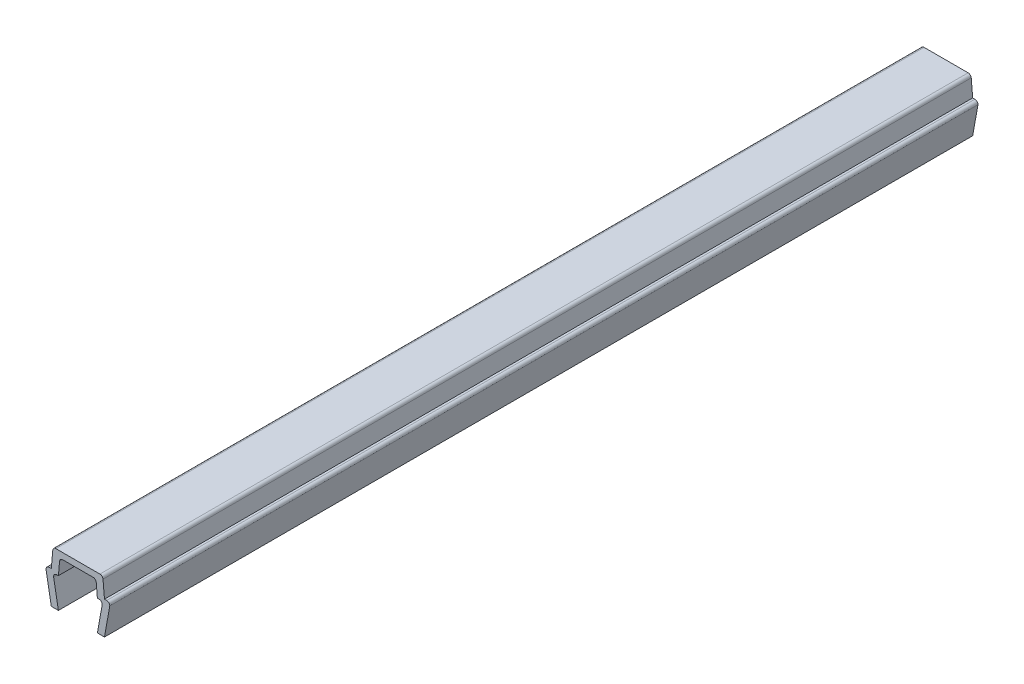
ISO-10303-21;
HEADER;
FILE_DESCRIPTION(('STEP AP214'),'2;1');
FILE_NAME('part.step','',(''),(''),'','','');
FILE_SCHEMA(('AUTOMOTIVE_DESIGN { 1 0 10303 214 1 1 1 1 }'));
ENDSEC;
DATA;
#1=APPLICATION_CONTEXT('core data for automotive mechanical design processes');
#2=APPLICATION_PROTOCOL_DEFINITION('international standard','automotive_design',2000,#1);
#3=PRODUCT_CONTEXT('',#1,'mechanical');
#4=PRODUCT('Part','Part','',(#3));
#5=PRODUCT_RELATED_PRODUCT_CATEGORY('part','',(#4));
#6=PRODUCT_DEFINITION_FORMATION('','',#4);
#7=PRODUCT_DEFINITION_CONTEXT('part definition',#1,'design');
#8=PRODUCT_DEFINITION('design','',#6,#7);
#9=PRODUCT_DEFINITION_SHAPE('','',#8);
#10=(LENGTH_UNIT() NAMED_UNIT(*) SI_UNIT(.MILLI.,.METRE.));
#11=(NAMED_UNIT(*) PLANE_ANGLE_UNIT() SI_UNIT($,.RADIAN.));
#12=(NAMED_UNIT(*) SI_UNIT($,.STERADIAN.) SOLID_ANGLE_UNIT());
#13=UNCERTAINTY_MEASURE_WITH_UNIT(LENGTH_MEASURE(1.E-05),#10,'distance_accuracy_value','');
#14=(GEOMETRIC_REPRESENTATION_CONTEXT(3) GLOBAL_UNCERTAINTY_ASSIGNED_CONTEXT((#13)) GLOBAL_UNIT_ASSIGNED_CONTEXT((#10,
#11,#12)) REPRESENTATION_CONTEXT('',''));
#15=CARTESIAN_POINT('',(0.,0.,0.));
#16=DIRECTION('',(0.,0.,1.));
#17=DIRECTION('',(1.,0.,0.));
#18=AXIS2_PLACEMENT_3D('',#15,#16,#17);
#19=CARTESIAN_POINT('',(-3.25000000000003,3.35000000000003,49.));
#20=DIRECTION('',(0.,0.,-1.));
#21=DIRECTION('',(-1.,0.,0.));
#22=AXIS2_PLACEMENT_3D('',#19,#20,#21);
#23=CYLINDRICAL_SURFACE('',#22,0.349999999999972);
#24=DIRECTION('',(0.,0.,-1.));
#25=VECTOR('',#24,1.);
#26=CARTESIAN_POINT('',(-3.25,3.7,49.));
#27=LINE('',#26,#25);
#28=CARTESIAN_POINT('',(-3.25,3.7,49.));
#29=VERTEX_POINT('',#28);
#30=CARTESIAN_POINT('',(-3.25,3.7,-49.));
#31=VERTEX_POINT('',#30);
#32=EDGE_CURVE('E211',#29,#31,#27,.T.);
#33=ORIENTED_EDGE('',*,*,#32,.T.);
#34=CARTESIAN_POINT('',(-3.25000000000003,3.35000000000003,-49.));
#35=DIRECTION('',(0.,0.,1.));
#36=DIRECTION('',(1.,0.,0.));
#37=AXIS2_PLACEMENT_3D('',#34,#35,#36);
#38=CIRCLE('',#37,0.349999999999972);
#39=CARTESIAN_POINT('',(-3.6,3.35,-49.));
#40=VERTEX_POINT('',#39);
#41=EDGE_CURVE('E205',#31,#40,#38,.T.);
#42=ORIENTED_EDGE('',*,*,#41,.T.);
#43=DIRECTION('',(0.,0.,-1.));
#44=VECTOR('',#43,1.);
#45=CARTESIAN_POINT('',(-3.6,3.35,49.));
#46=LINE('',#45,#44);
#47=CARTESIAN_POINT('',(-3.6,3.35,49.));
#48=VERTEX_POINT('',#47);
#49=EDGE_CURVE('E11',#48,#40,#46,.T.);
#50=ORIENTED_EDGE('',*,*,#49,.F.);
#51=CARTESIAN_POINT('',(-3.25000000000003,3.35000000000003,49.));
#52=DIRECTION('',(0.,0.,1.));
#53=DIRECTION('',(1.,0.,0.));
#54=AXIS2_PLACEMENT_3D('',#51,#52,#53);
#55=CIRCLE('',#54,0.349999999999972);
#56=EDGE_CURVE('E277',#29,#48,#55,.T.);
#57=ORIENTED_EDGE('',*,*,#56,.F.);
#58=EDGE_LOOP('',(#33,#42,#50,#57));
#59=FACE_BOUND('',#58,.T.);
#60=ADVANCED_FACE('F33',(#59),#23,.T.);
#61=CARTESIAN_POINT('',(-3.6,3.35,49.));
#62=DIRECTION('',(0.984336643247304,0.176299100283099,0.));
#63=DIRECTION('',(-0.176299100283099,0.984336643247304,0.));
#64=AXIS2_PLACEMENT_3D('',#61,#62,#63);
#65=PLANE('',#64);
#66=ORIENTED_EDGE('',*,*,#49,.T.);
#67=DIRECTION('',(0.176299100283099,-0.984336643247304,0.));
#68=VECTOR('',#67,1.);
#69=CARTESIAN_POINT('',(-3.6,3.35,-49.));
#70=LINE('',#69,#68);
#71=CARTESIAN_POINT('',(-3.,0.,-49.));
#72=VERTEX_POINT('',#71);
#73=EDGE_CURVE('E195',#40,#72,#70,.T.);
#74=ORIENTED_EDGE('',*,*,#73,.T.);
#75=DIRECTION('',(0.,0.,-1.));
#76=VECTOR('',#75,1.);
#77=CARTESIAN_POINT('',(-3.,0.,49.));
#78=LINE('',#77,#76);
#79=CARTESIAN_POINT('',(-3.,0.,49.));
#80=VERTEX_POINT('',#79);
#81=EDGE_CURVE('E40',#80,#72,#78,.T.);
#82=ORIENTED_EDGE('',*,*,#81,.F.);
#83=DIRECTION('',(0.176299100283099,-0.984336643247304,0.));
#84=VECTOR('',#83,1.);
#85=CARTESIAN_POINT('',(-3.6,3.35,49.));
#86=LINE('',#85,#84);
#87=EDGE_CURVE('E196',#48,#80,#86,.T.);
#88=ORIENTED_EDGE('',*,*,#87,.F.);
#89=EDGE_LOOP('',(#66,#74,#82,#88));
#90=FACE_BOUND('',#89,.T.);
#91=ADVANCED_FACE('F193',(#90),#65,.F.);
#92=CARTESIAN_POINT('',(-3.,0.,49.));
#93=DIRECTION('',(0.,1.,0.));
#94=DIRECTION('',(0.,0.,1.));
#95=AXIS2_PLACEMENT_3D('',#92,#93,#94);
#96=PLANE('',#95);
#97=ORIENTED_EDGE('',*,*,#81,.T.);
#98=DIRECTION('',(1.,0.,0.));
#99=VECTOR('',#98,1.);
#100=CARTESIAN_POINT('',(-3.,0.,-49.));
#101=LINE('',#100,#99);
#102=CARTESIAN_POINT('',(-2.2,0.,-49.));
#103=VERTEX_POINT('',#102);
#104=EDGE_CURVE('E209',#72,#103,#101,.T.);
#105=ORIENTED_EDGE('',*,*,#104,.T.);
#106=DIRECTION('',(0.,0.,-1.));
#107=VECTOR('',#106,1.);
#108=CARTESIAN_POINT('',(-2.2,0.,49.));
#109=LINE('',#108,#107);
#110=CARTESIAN_POINT('',(-2.2,0.,49.));
#111=VERTEX_POINT('',#110);
#112=EDGE_CURVE('E363',#111,#103,#109,.T.);
#113=ORIENTED_EDGE('',*,*,#112,.F.);
#114=DIRECTION('',(1.,0.,0.));
#115=VECTOR('',#114,1.);
#116=CARTESIAN_POINT('',(-3.,0.,49.));
#117=LINE('',#116,#115);
#118=EDGE_CURVE('E280',#80,#111,#117,.T.);
#119=ORIENTED_EDGE('',*,*,#118,.F.);
#120=EDGE_LOOP('',(#97,#105,#113,#119));
#121=FACE_BOUND('',#120,.T.);
#122=ADVANCED_FACE('F366',(#121),#96,.F.);
#123=CARTESIAN_POINT('',(-2.2,0.,49.));
#124=DIRECTION('',(-0.984336643247306,-0.176299100283088,0.));
#125=DIRECTION('',(0.176299100283088,-0.984336643247306,0.));
#126=AXIS2_PLACEMENT_3D('',#123,#124,#125);
#127=PLANE('',#126);
#128=ORIENTED_EDGE('',*,*,#112,.T.);
#129=DIRECTION('',(-0.176299100283088,0.984336643247306,0.));
#130=VECTOR('',#129,1.);
#131=CARTESIAN_POINT('',(-2.2,0.,-49.));
#132=LINE('',#131,#130);
#133=CARTESIAN_POINT('',(-2.7352170713255,2.9882953149009,-49.));
#134=VERTEX_POINT('',#133);
#135=EDGE_CURVE('E215',#103,#134,#132,.T.);
#136=ORIENTED_EDGE('',*,*,#135,.T.);
#137=DIRECTION('',(0.,0.,-1.));
#138=VECTOR('',#137,1.);
#139=CARTESIAN_POINT('',(-2.7352170713255,2.9882953149009,49.));
#140=LINE('',#139,#138);
#141=CARTESIAN_POINT('',(-2.7352170713255,2.9882953149009,49.));
#142=VERTEX_POINT('',#141);
#143=EDGE_CURVE('E361',#142,#134,#140,.T.);
#144=ORIENTED_EDGE('',*,*,#143,.F.);
#145=DIRECTION('',(-0.176299100283088,0.984336643247306,0.));
#146=VECTOR('',#145,1.);
#147=CARTESIAN_POINT('',(-2.2,0.,49.));
#148=LINE('',#147,#146);
#149=EDGE_CURVE('E282',#111,#142,#148,.T.);
#150=ORIENTED_EDGE('',*,*,#149,.F.);
#151=EDGE_LOOP('',(#128,#136,#144,#150));
#152=FACE_BOUND('',#151,.T.);
#153=ADVANCED_FACE('F374',(#152),#127,.F.);
#154=CARTESIAN_POINT('',(-2.390699246189,3.05000000000004,49.));
#155=DIRECTION('',(0.,0.,-1.));
#156=DIRECTION('',(-1.,0.,0.));
#157=AXIS2_PLACEMENT_3D('',#154,#155,#156);
#158=CYLINDRICAL_SURFACE('',#157,0.349999999999955);
#159=ORIENTED_EDGE('',*,*,#143,.T.);
#160=CARTESIAN_POINT('',(-2.390699246189,3.05000000000004,-49.));
#161=DIRECTION('',(0.,0.,-1.));
#162=DIRECTION('',(-1.,0.,0.));
#163=AXIS2_PLACEMENT_3D('',#160,#161,#162);
#164=CIRCLE('',#163,0.349999999999955);
#165=CARTESIAN_POINT('',(-2.390699246189,3.4,-49.));
#166=VERTEX_POINT('',#165);
#167=EDGE_CURVE('E218',#134,#166,#164,.T.);
#168=ORIENTED_EDGE('',*,*,#167,.T.);
#169=DIRECTION('',(0.,0.,-1.));
#170=VECTOR('',#169,1.);
#171=CARTESIAN_POINT('',(-2.390699246189,3.4,49.));
#172=LINE('',#171,#170);
#173=CARTESIAN_POINT('',(-2.390699246189,3.4,49.));
#174=VERTEX_POINT('',#173);
#175=EDGE_CURVE('E359',#174,#166,#172,.T.);
#176=ORIENTED_EDGE('',*,*,#175,.F.);
#177=CARTESIAN_POINT('',(-2.390699246189,3.05000000000004,49.));
#178=DIRECTION('',(0.,0.,-1.));
#179=DIRECTION('',(-1.,0.,0.));
#180=AXIS2_PLACEMENT_3D('',#177,#178,#179);
#181=CIRCLE('',#180,0.349999999999955);
#182=EDGE_CURVE('E284',#142,#174,#181,.T.);
#183=ORIENTED_EDGE('',*,*,#182,.F.);
#184=EDGE_LOOP('',(#159,#168,#176,#183));
#185=FACE_BOUND('',#184,.T.);
#186=ADVANCED_FACE('F377',(#185),#158,.F.);
#187=CARTESIAN_POINT('',(-2.390699246189,3.4,49.));
#188=DIRECTION('',(0.,1.,0.));
#189=DIRECTION('',(0.,0.,1.));
#190=AXIS2_PLACEMENT_3D('',#187,#188,#189);
#191=PLANE('',#190);
#192=ORIENTED_EDGE('',*,*,#175,.T.);
#193=DIRECTION('',(1.,0.,0.));
#194=VECTOR('',#193,1.);
#195=CARTESIAN_POINT('',(-2.390699246189,3.4,-49.));
#196=LINE('',#195,#194);
#197=CARTESIAN_POINT('',(-2.2,3.4,-49.));
#198=VERTEX_POINT('',#197);
#199=EDGE_CURVE('E221',#166,#198,#196,.T.);
#200=ORIENTED_EDGE('',*,*,#199,.T.);
#201=DIRECTION('',(0.,0.,-1.));
#202=VECTOR('',#201,1.);
#203=CARTESIAN_POINT('',(-2.2,3.4,49.));
#204=LINE('',#203,#202);
#205=CARTESIAN_POINT('',(-2.2,3.4,49.));
#206=VERTEX_POINT('',#205);
#207=EDGE_CURVE('E357',#206,#198,#204,.T.);
#208=ORIENTED_EDGE('',*,*,#207,.F.);
#209=DIRECTION('',(1.,0.,0.));
#210=VECTOR('',#209,1.);
#211=CARTESIAN_POINT('',(-2.390699246189,3.4,49.));
#212=LINE('',#211,#210);
#213=EDGE_CURVE('E286',#174,#206,#212,.T.);
#214=ORIENTED_EDGE('',*,*,#213,.F.);
#215=EDGE_LOOP('',(#192,#200,#208,#214));
#216=FACE_BOUND('',#215,.T.);
#217=ADVANCED_FACE('F382',(#216),#191,.F.);
#218=CARTESIAN_POINT('',(-2.2,3.4,49.));
#219=DIRECTION('',(-0.996194698091743,0.08715574274769,0.));
#220=DIRECTION('',(-0.08715574274769,-0.996194698091743,0.));
#221=AXIS2_PLACEMENT_3D('',#218,#219,#220);
#222=PLANE('',#221);
#223=ORIENTED_EDGE('',*,*,#207,.T.);
#224=DIRECTION('',(0.08715574274769,0.996194698091743,0.));
#225=VECTOR('',#224,1.);
#226=CARTESIAN_POINT('',(-2.2,3.4,-49.));
#227=LINE('',#226,#225);
#228=CARTESIAN_POINT('',(-2.0704726390793,4.8805045099617,-49.));
#229=VERTEX_POINT('',#228);
#230=EDGE_CURVE('E224',#198,#229,#227,.T.);
#231=ORIENTED_EDGE('',*,*,#230,.T.);
#232=DIRECTION('',(0.,0.,-1.));
#233=VECTOR('',#232,1.);
#234=CARTESIAN_POINT('',(-2.0704726390793,4.8805045099617,49.));
#235=LINE('',#234,#233);
#236=CARTESIAN_POINT('',(-2.0704726390793,4.8805045099617,49.));
#237=VERTEX_POINT('',#236);
#238=EDGE_CURVE('E355',#237,#229,#235,.T.);
#239=ORIENTED_EDGE('',*,*,#238,.F.);
#240=DIRECTION('',(0.08715574274769,0.996194698091743,0.));
#241=VECTOR('',#240,1.);
#242=CARTESIAN_POINT('',(-2.2,3.4,49.));
#243=LINE('',#242,#241);
#244=EDGE_CURVE('E288',#206,#237,#243,.T.);
#245=ORIENTED_EDGE('',*,*,#244,.F.);
#246=EDGE_LOOP('',(#223,#231,#239,#245));
#247=FACE_BOUND('',#246,.T.);
#248=ADVANCED_FACE('F388',(#247),#222,.F.);
#249=CARTESIAN_POINT('',(-1.72180449474716,4.84999999999996,49.));
#250=DIRECTION('',(0.,0.,-1.));
#251=DIRECTION('',(-1.,0.,0.));
#252=AXIS2_PLACEMENT_3D('',#249,#250,#251);
#253=CYLINDRICAL_SURFACE('',#252,0.350000000000036);
#254=ORIENTED_EDGE('',*,*,#238,.T.);
#255=CARTESIAN_POINT('',(-1.72180449474716,4.84999999999996,-49.));
#256=DIRECTION('',(0.,0.,-1.));
#257=DIRECTION('',(-1.,0.,0.));
#258=AXIS2_PLACEMENT_3D('',#255,#256,#257);
#259=CIRCLE('',#258,0.350000000000036);
#260=CARTESIAN_POINT('',(-1.7218044947472,5.2,-49.));
#261=VERTEX_POINT('',#260);
#262=EDGE_CURVE('E227',#229,#261,#259,.T.);
#263=ORIENTED_EDGE('',*,*,#262,.T.);
#264=DIRECTION('',(0.,0.,-1.));
#265=VECTOR('',#264,1.);
#266=CARTESIAN_POINT('',(-1.7218044947472,5.2,49.));
#267=LINE('',#266,#265);
#268=CARTESIAN_POINT('',(-1.7218044947472,5.2,49.));
#269=VERTEX_POINT('',#268);
#270=EDGE_CURVE('E353',#269,#261,#267,.T.);
#271=ORIENTED_EDGE('',*,*,#270,.F.);
#272=CARTESIAN_POINT('',(-1.72180449474716,4.84999999999996,49.));
#273=DIRECTION('',(0.,0.,-1.));
#274=DIRECTION('',(-1.,0.,0.));
#275=AXIS2_PLACEMENT_3D('',#272,#273,#274);
#276=CIRCLE('',#275,0.350000000000036);
#277=EDGE_CURVE('E290',#237,#269,#276,.T.);
#278=ORIENTED_EDGE('',*,*,#277,.F.);
#279=EDGE_LOOP('',(#254,#263,#271,#278));
#280=FACE_BOUND('',#279,.T.);
#281=ADVANCED_FACE('F392',(#280),#253,.F.);
#282=CARTESIAN_POINT('',(-1.7218044947472,5.2,49.));
#283=DIRECTION('',(0.,1.,0.));
#284=DIRECTION('',(0.,0.,1.));
#285=AXIS2_PLACEMENT_3D('',#282,#283,#284);
#286=PLANE('',#285);
#287=ORIENTED_EDGE('',*,*,#270,.T.);
#288=DIRECTION('',(1.,0.,0.));
#289=VECTOR('',#288,1.);
#290=CARTESIAN_POINT('',(-1.7218044947472,5.2,-49.));
#291=LINE('',#290,#289);
#292=CARTESIAN_POINT('',(1.7218044947472,5.2,-49.));
#293=VERTEX_POINT('',#292);
#294=EDGE_CURVE('E230',#261,#293,#291,.T.);
#295=ORIENTED_EDGE('',*,*,#294,.T.);
#296=DIRECTION('',(0.,0.,-1.));
#297=VECTOR('',#296,1.);
#298=CARTESIAN_POINT('',(1.7218044947472,5.2,49.));
#299=LINE('',#298,#297);
#300=CARTESIAN_POINT('',(1.7218044947472,5.2,49.));
#301=VERTEX_POINT('',#300);
#302=EDGE_CURVE('E351',#301,#293,#299,.T.);
#303=ORIENTED_EDGE('',*,*,#302,.F.);
#304=DIRECTION('',(1.,0.,0.));
#305=VECTOR('',#304,1.);
#306=CARTESIAN_POINT('',(-1.7218044947472,5.2,49.));
#307=LINE('',#306,#305);
#308=EDGE_CURVE('E292',#269,#301,#307,.T.);
#309=ORIENTED_EDGE('',*,*,#308,.F.);
#310=EDGE_LOOP('',(#287,#295,#303,#309));
#311=FACE_BOUND('',#310,.T.);
#312=ADVANCED_FACE('F397',(#311),#286,.F.);
#313=CARTESIAN_POINT('',(1.72180449474716,4.84999999999996,49.));
#314=DIRECTION('',(0.,0.,-1.));
#315=DIRECTION('',(-1.,0.,0.));
#316=AXIS2_PLACEMENT_3D('',#313,#314,#315);
#317=CYLINDRICAL_SURFACE('',#316,0.350000000000036);
#318=ORIENTED_EDGE('',*,*,#302,.T.);
#319=CARTESIAN_POINT('',(1.72180449474716,4.84999999999996,-49.));
#320=DIRECTION('',(0.,0.,-1.));
#321=DIRECTION('',(-1.,0.,0.));
#322=AXIS2_PLACEMENT_3D('',#319,#320,#321);
#323=CIRCLE('',#322,0.350000000000036);
#324=CARTESIAN_POINT('',(2.0704726390793,4.8805045099617,-49.));
#325=VERTEX_POINT('',#324);
#326=EDGE_CURVE('E233',#293,#325,#323,.T.);
#327=ORIENTED_EDGE('',*,*,#326,.T.);
#328=DIRECTION('',(0.,0.,-1.));
#329=VECTOR('',#328,1.);
#330=CARTESIAN_POINT('',(2.0704726390793,4.8805045099617,49.));
#331=LINE('',#330,#329);
#332=CARTESIAN_POINT('',(2.0704726390793,4.8805045099617,49.));
#333=VERTEX_POINT('',#332);
#334=EDGE_CURVE('E349',#333,#325,#331,.T.);
#335=ORIENTED_EDGE('',*,*,#334,.F.);
#336=CARTESIAN_POINT('',(1.72180449474716,4.84999999999996,49.));
#337=DIRECTION('',(0.,0.,-1.));
#338=DIRECTION('',(-1.,0.,0.));
#339=AXIS2_PLACEMENT_3D('',#336,#337,#338);
#340=CIRCLE('',#339,0.350000000000036);
#341=EDGE_CURVE('E294',#301,#333,#340,.T.);
#342=ORIENTED_EDGE('',*,*,#341,.F.);
#343=EDGE_LOOP('',(#318,#327,#335,#342));
#344=FACE_BOUND('',#343,.T.);
#345=ADVANCED_FACE('F403',(#344),#317,.F.);
#346=CARTESIAN_POINT('',(2.0704726390793,4.8805045099617,49.));
#347=DIRECTION('',(0.996194698091743,0.08715574274769,0.));
#348=DIRECTION('',(-0.08715574274769,0.996194698091743,0.));
#349=AXIS2_PLACEMENT_3D('',#346,#347,#348);
#350=PLANE('',#349);
#351=ORIENTED_EDGE('',*,*,#334,.T.);
#352=DIRECTION('',(0.08715574274769,-0.996194698091743,0.));
#353=VECTOR('',#352,1.);
#354=CARTESIAN_POINT('',(2.0704726390793,4.8805045099617,-49.));
#355=LINE('',#354,#353);
#356=CARTESIAN_POINT('',(2.2,3.4,-49.));
#357=VERTEX_POINT('',#356);
#358=EDGE_CURVE('E236',#325,#357,#355,.T.);
#359=ORIENTED_EDGE('',*,*,#358,.T.);
#360=DIRECTION('',(0.,0.,-1.));
#361=VECTOR('',#360,1.);
#362=CARTESIAN_POINT('',(2.2,3.4,49.));
#363=LINE('',#362,#361);
#364=CARTESIAN_POINT('',(2.2,3.4,49.));
#365=VERTEX_POINT('',#364);
#366=EDGE_CURVE('E347',#365,#357,#363,.T.);
#367=ORIENTED_EDGE('',*,*,#366,.F.);
#368=DIRECTION('',(0.08715574274769,-0.996194698091743,0.));
#369=VECTOR('',#368,1.);
#370=CARTESIAN_POINT('',(2.0704726390793,4.8805045099617,49.));
#371=LINE('',#370,#369);
#372=EDGE_CURVE('E296',#333,#365,#371,.T.);
#373=ORIENTED_EDGE('',*,*,#372,.F.);
#374=EDGE_LOOP('',(#351,#359,#367,#373));
#375=FACE_BOUND('',#374,.T.);
#376=ADVANCED_FACE('F407',(#375),#350,.F.);
#377=CARTESIAN_POINT('',(2.2,3.4,49.));
#378=DIRECTION('',(0.,1.,0.));
#379=DIRECTION('',(0.,0.,1.));
#380=AXIS2_PLACEMENT_3D('',#377,#378,#379);
#381=PLANE('',#380);
#382=ORIENTED_EDGE('',*,*,#366,.T.);
#383=DIRECTION('',(1.,0.,0.));
#384=VECTOR('',#383,1.);
#385=CARTESIAN_POINT('',(2.2,3.4,-49.));
#386=LINE('',#385,#384);
#387=CARTESIAN_POINT('',(2.390699246189,3.4,-49.));
#388=VERTEX_POINT('',#387);
#389=EDGE_CURVE('E239',#357,#388,#386,.T.);
#390=ORIENTED_EDGE('',*,*,#389,.T.);
#391=DIRECTION('',(0.,0.,-1.));
#392=VECTOR('',#391,1.);
#393=CARTESIAN_POINT('',(2.390699246189,3.4,49.));
#394=LINE('',#393,#392);
#395=CARTESIAN_POINT('',(2.390699246189,3.4,49.));
#396=VERTEX_POINT('',#395);
#397=EDGE_CURVE('E345',#396,#388,#394,.T.);
#398=ORIENTED_EDGE('',*,*,#397,.F.);
#399=DIRECTION('',(1.,0.,0.));
#400=VECTOR('',#399,1.);
#401=CARTESIAN_POINT('',(2.2,3.4,49.));
#402=LINE('',#401,#400);
#403=EDGE_CURVE('E298',#365,#396,#402,.T.);
#404=ORIENTED_EDGE('',*,*,#403,.F.);
#405=EDGE_LOOP('',(#382,#390,#398,#404));
#406=FACE_BOUND('',#405,.T.);
#407=ADVANCED_FACE('F412',(#406),#381,.F.);
#408=CARTESIAN_POINT('',(2.390699246189,3.05000000000004,49.));
#409=DIRECTION('',(0.,0.,-1.));
#410=DIRECTION('',(-1.,0.,0.));
#411=AXIS2_PLACEMENT_3D('',#408,#409,#410);
#412=CYLINDRICAL_SURFACE('',#411,0.349999999999955);
#413=ORIENTED_EDGE('',*,*,#397,.T.);
#414=CARTESIAN_POINT('',(2.390699246189,3.05000000000004,-49.));
#415=DIRECTION('',(0.,0.,-1.));
#416=DIRECTION('',(-1.,0.,0.));
#417=AXIS2_PLACEMENT_3D('',#414,#415,#416);
#418=CIRCLE('',#417,0.349999999999955);
#419=CARTESIAN_POINT('',(2.7352170713255,2.9882953149009,-49.));
#420=VERTEX_POINT('',#419);
#421=EDGE_CURVE('E242',#388,#420,#418,.T.);
#422=ORIENTED_EDGE('',*,*,#421,.T.);
#423=DIRECTION('',(0.,0.,-1.));
#424=VECTOR('',#423,1.);
#425=CARTESIAN_POINT('',(2.7352170713255,2.9882953149009,49.));
#426=LINE('',#425,#424);
#427=CARTESIAN_POINT('',(2.7352170713255,2.9882953149009,49.));
#428=VERTEX_POINT('',#427);
#429=EDGE_CURVE('E343',#428,#420,#426,.T.);
#430=ORIENTED_EDGE('',*,*,#429,.F.);
#431=CARTESIAN_POINT('',(2.390699246189,3.05000000000004,49.));
#432=DIRECTION('',(0.,0.,-1.));
#433=DIRECTION('',(-1.,0.,0.));
#434=AXIS2_PLACEMENT_3D('',#431,#432,#433);
#435=CIRCLE('',#434,0.349999999999955);
#436=EDGE_CURVE('E300',#396,#428,#435,.T.);
#437=ORIENTED_EDGE('',*,*,#436,.F.);
#438=EDGE_LOOP('',(#413,#422,#430,#437));
#439=FACE_BOUND('',#438,.T.);
#440=ADVANCED_FACE('F418',(#439),#412,.F.);
#441=CARTESIAN_POINT('',(2.7352170713255,2.9882953149009,49.));
#442=DIRECTION('',(0.984336643247306,-0.176299100283088,0.));
#443=DIRECTION('',(0.176299100283088,0.984336643247306,0.));
#444=AXIS2_PLACEMENT_3D('',#441,#442,#443);
#445=PLANE('',#444);
#446=ORIENTED_EDGE('',*,*,#429,.T.);
#447=DIRECTION('',(-0.176299100283088,-0.984336643247306,0.));
#448=VECTOR('',#447,1.);
#449=CARTESIAN_POINT('',(2.7352170713255,2.9882953149009,-49.));
#450=LINE('',#449,#448);
#451=CARTESIAN_POINT('',(2.2,0.,-49.));
#452=VERTEX_POINT('',#451);
#453=EDGE_CURVE('E245',#420,#452,#450,.T.);
#454=ORIENTED_EDGE('',*,*,#453,.T.);
#455=DIRECTION('',(0.,0.,-1.));
#456=VECTOR('',#455,1.);
#457=CARTESIAN_POINT('',(2.2,0.,49.));
#458=LINE('',#457,#456);
#459=CARTESIAN_POINT('',(2.2,0.,49.));
#460=VERTEX_POINT('',#459);
#461=EDGE_CURVE('E341',#460,#452,#458,.T.);
#462=ORIENTED_EDGE('',*,*,#461,.F.);
#463=DIRECTION('',(-0.176299100283088,-0.984336643247306,0.));
#464=VECTOR('',#463,1.);
#465=CARTESIAN_POINT('',(2.7352170713255,2.9882953149009,49.));
#466=LINE('',#465,#464);
#467=EDGE_CURVE('E302',#428,#460,#466,.T.);
#468=ORIENTED_EDGE('',*,*,#467,.F.);
#469=EDGE_LOOP('',(#446,#454,#462,#468));
#470=FACE_BOUND('',#469,.T.);
#471=ADVANCED_FACE('F422',(#470),#445,.F.);
#472=CARTESIAN_POINT('',(2.2,0.,49.));
#473=DIRECTION('',(0.,1.,0.));
#474=DIRECTION('',(0.,0.,1.));
#475=AXIS2_PLACEMENT_3D('',#472,#473,#474);
#476=PLANE('',#475);
#477=ORIENTED_EDGE('',*,*,#461,.T.);
#478=DIRECTION('',(1.,0.,0.));
#479=VECTOR('',#478,1.);
#480=CARTESIAN_POINT('',(2.2,0.,-49.));
#481=LINE('',#480,#479);
#482=CARTESIAN_POINT('',(3.,0.,-49.));
#483=VERTEX_POINT('',#482);
#484=EDGE_CURVE('E248',#452,#483,#481,.T.);
#485=ORIENTED_EDGE('',*,*,#484,.T.);
#486=DIRECTION('',(0.,0.,-1.));
#487=VECTOR('',#486,1.);
#488=CARTESIAN_POINT('',(3.,0.,49.));
#489=LINE('',#488,#487);
#490=CARTESIAN_POINT('',(3.,0.,49.));
#491=VERTEX_POINT('',#490);
#492=EDGE_CURVE('E339',#491,#483,#489,.T.);
#493=ORIENTED_EDGE('',*,*,#492,.F.);
#494=DIRECTION('',(1.,0.,0.));
#495=VECTOR('',#494,1.);
#496=CARTESIAN_POINT('',(2.2,0.,49.));
#497=LINE('',#496,#495);
#498=EDGE_CURVE('E304',#460,#491,#497,.T.);
#499=ORIENTED_EDGE('',*,*,#498,.F.);
#500=EDGE_LOOP('',(#477,#485,#493,#499));
#501=FACE_BOUND('',#500,.T.);
#502=ADVANCED_FACE('F427',(#501),#476,.F.);
#503=CARTESIAN_POINT('',(3.,0.,49.));
#504=DIRECTION('',(-0.984336643247304,0.176299100283099,0.));
#505=DIRECTION('',(-0.176299100283099,-0.984336643247304,0.));
#506=AXIS2_PLACEMENT_3D('',#503,#504,#505);
#507=PLANE('',#506);
#508=ORIENTED_EDGE('',*,*,#492,.T.);
#509=DIRECTION('',(0.176299100283099,0.984336643247304,0.));
#510=VECTOR('',#509,1.);
#511=CARTESIAN_POINT('',(3.,0.,-49.));
#512=LINE('',#511,#510);
#513=CARTESIAN_POINT('',(3.6,3.35,-49.));
#514=VERTEX_POINT('',#513);
#515=EDGE_CURVE('E251',#483,#514,#512,.T.);
#516=ORIENTED_EDGE('',*,*,#515,.T.);
#517=DIRECTION('',(0.,0.,-1.));
#518=VECTOR('',#517,1.);
#519=CARTESIAN_POINT('',(3.6,3.35,49.));
#520=LINE('',#519,#518);
#521=CARTESIAN_POINT('',(3.6,3.35,49.));
#522=VERTEX_POINT('',#521);
#523=EDGE_CURVE('E337',#522,#514,#520,.T.);
#524=ORIENTED_EDGE('',*,*,#523,.F.);
#525=DIRECTION('',(0.176299100283099,0.984336643247304,0.));
#526=VECTOR('',#525,1.);
#527=CARTESIAN_POINT('',(3.,0.,49.));
#528=LINE('',#527,#526);
#529=EDGE_CURVE('E306',#491,#522,#528,.T.);
#530=ORIENTED_EDGE('',*,*,#529,.F.);
#531=EDGE_LOOP('',(#508,#516,#524,#530));
#532=FACE_BOUND('',#531,.T.);
#533=ADVANCED_FACE('F433',(#532),#507,.F.);
#534=CARTESIAN_POINT('',(3.25000000000003,3.35000000000003,49.));
#535=DIRECTION('',(0.,0.,-1.));
#536=DIRECTION('',(-1.,0.,0.));
#537=AXIS2_PLACEMENT_3D('',#534,#535,#536);
#538=CYLINDRICAL_SURFACE('',#537,0.349999999999972);
#539=ORIENTED_EDGE('',*,*,#523,.T.);
#540=CARTESIAN_POINT('',(3.25000000000003,3.35000000000003,-49.));
#541=DIRECTION('',(0.,0.,1.));
#542=DIRECTION('',(1.,0.,0.));
#543=AXIS2_PLACEMENT_3D('',#540,#541,#542);
#544=CIRCLE('',#543,0.349999999999972);
#545=CARTESIAN_POINT('',(3.25,3.7,-49.));
#546=VERTEX_POINT('',#545);
#547=EDGE_CURVE('E254',#514,#546,#544,.T.);
#548=ORIENTED_EDGE('',*,*,#547,.T.);
#549=DIRECTION('',(0.,0.,-1.));
#550=VECTOR('',#549,1.);
#551=CARTESIAN_POINT('',(3.25,3.7,49.));
#552=LINE('',#551,#550);
#553=CARTESIAN_POINT('',(3.25,3.7,49.));
#554=VERTEX_POINT('',#553);
#555=EDGE_CURVE('E335',#554,#546,#552,.T.);
#556=ORIENTED_EDGE('',*,*,#555,.F.);
#557=CARTESIAN_POINT('',(3.25000000000003,3.35000000000003,49.));
#558=DIRECTION('',(0.,0.,1.));
#559=DIRECTION('',(1.,0.,0.));
#560=AXIS2_PLACEMENT_3D('',#557,#558,#559);
#561=CIRCLE('',#560,0.349999999999972);
#562=EDGE_CURVE('E308',#522,#554,#561,.T.);
#563=ORIENTED_EDGE('',*,*,#562,.F.);
#564=EDGE_LOOP('',(#539,#548,#556,#563));
#565=FACE_BOUND('',#564,.T.);
#566=ADVANCED_FACE('F437',(#565),#538,.T.);
#567=CARTESIAN_POINT('',(3.25,3.7,49.));
#568=DIRECTION('',(0.,-1.,0.));
#569=DIRECTION('',(0.,0.,-1.));
#570=AXIS2_PLACEMENT_3D('',#567,#568,#569);
#571=PLANE('',#570);
#572=ORIENTED_EDGE('',*,*,#555,.T.);
#573=DIRECTION('',(-1.,0.,0.));
#574=VECTOR('',#573,1.);
#575=CARTESIAN_POINT('',(3.25,3.7,-49.));
#576=LINE('',#575,#574);
#577=CARTESIAN_POINT('',(3.,3.7,-49.));
#578=VERTEX_POINT('',#577);
#579=EDGE_CURVE('E257',#546,#578,#576,.T.);
#580=ORIENTED_EDGE('',*,*,#579,.T.);
#581=DIRECTION('',(0.,0.,-1.));
#582=VECTOR('',#581,1.);
#583=CARTESIAN_POINT('',(3.,3.7,49.));
#584=LINE('',#583,#582);
#585=CARTESIAN_POINT('',(3.,3.7,49.));
#586=VERTEX_POINT('',#585);
#587=EDGE_CURVE('E333',#586,#578,#584,.T.);
#588=ORIENTED_EDGE('',*,*,#587,.F.);
#589=DIRECTION('',(-1.,0.,0.));
#590=VECTOR('',#589,1.);
#591=CARTESIAN_POINT('',(3.25,3.7,49.));
#592=LINE('',#591,#590);
#593=EDGE_CURVE('E310',#554,#586,#592,.T.);
#594=ORIENTED_EDGE('',*,*,#593,.F.);
#595=EDGE_LOOP('',(#572,#580,#588,#594));
#596=FACE_BOUND('',#595,.T.);
#597=ADVANCED_FACE('F442',(#596),#571,.F.);
#598=CARTESIAN_POINT('',(3.,3.7,49.));
#599=DIRECTION('',(-0.996194698091747,-0.0871557427476467,0.));
#600=DIRECTION('',(0.0871557427476467,-0.996194698091747,0.));
#601=AXIS2_PLACEMENT_3D('',#598,#599,#600);
#602=PLANE('',#601);
#603=ORIENTED_EDGE('',*,*,#587,.T.);
#604=DIRECTION('',(-0.0871557427476467,0.996194698091747,0.));
#605=VECTOR('',#604,1.);
#606=CARTESIAN_POINT('',(3.,3.7,-49.));
#607=LINE('',#606,#605);
#608=CARTESIAN_POINT('',(2.835477173669,5.5805045099617,-49.));
#609=VERTEX_POINT('',#608);
#610=EDGE_CURVE('E260',#578,#609,#607,.T.);
#611=ORIENTED_EDGE('',*,*,#610,.T.);
#612=DIRECTION('',(0.,0.,-1.));
#613=VECTOR('',#612,1.);
#614=CARTESIAN_POINT('',(2.835477173669,5.5805045099617,49.));
#615=LINE('',#614,#613);
#616=CARTESIAN_POINT('',(2.835477173669,5.5805045099617,49.));
#617=VERTEX_POINT('',#616);
#618=EDGE_CURVE('E331',#617,#609,#615,.T.);
#619=ORIENTED_EDGE('',*,*,#618,.F.);
#620=DIRECTION('',(-0.0871557427476467,0.996194698091747,0.));
#621=VECTOR('',#620,1.);
#622=CARTESIAN_POINT('',(3.,3.7,49.));
#623=LINE('',#622,#621);
#624=EDGE_CURVE('E312',#586,#617,#623,.T.);
#625=ORIENTED_EDGE('',*,*,#624,.F.);
#626=EDGE_LOOP('',(#603,#611,#619,#625));
#627=FACE_BOUND('',#626,.T.);
#628=ADVANCED_FACE('F448',(#627),#602,.F.);
#629=CARTESIAN_POINT('',(2.48680902933686,5.54999999999996,49.));
#630=DIRECTION('',(0.,0.,-1.));
#631=DIRECTION('',(-1.,0.,0.));
#632=AXIS2_PLACEMENT_3D('',#629,#630,#631);
#633=CYLINDRICAL_SURFACE('',#632,0.350000000000036);
#634=ORIENTED_EDGE('',*,*,#618,.T.);
#635=CARTESIAN_POINT('',(2.48680902933686,5.54999999999996,-49.));
#636=DIRECTION('',(0.,0.,1.));
#637=DIRECTION('',(1.,0.,0.));
#638=AXIS2_PLACEMENT_3D('',#635,#636,#637);
#639=CIRCLE('',#638,0.350000000000036);
#640=CARTESIAN_POINT('',(2.4868090293369,5.9,-49.));
#641=VERTEX_POINT('',#640);
#642=EDGE_CURVE('E263',#609,#641,#639,.T.);
#643=ORIENTED_EDGE('',*,*,#642,.T.);
#644=DIRECTION('',(0.,0.,-1.));
#645=VECTOR('',#644,1.);
#646=CARTESIAN_POINT('',(2.4868090293369,5.9,49.));
#647=LINE('',#646,#645);
#648=CARTESIAN_POINT('',(2.4868090293369,5.9,49.));
#649=VERTEX_POINT('',#648);
#650=EDGE_CURVE('E329',#649,#641,#647,.T.);
#651=ORIENTED_EDGE('',*,*,#650,.F.);
#652=CARTESIAN_POINT('',(2.48680902933686,5.54999999999996,49.));
#653=DIRECTION('',(0.,0.,1.));
#654=DIRECTION('',(1.,0.,0.));
#655=AXIS2_PLACEMENT_3D('',#652,#653,#654);
#656=CIRCLE('',#655,0.350000000000036);
#657=EDGE_CURVE('E314',#617,#649,#656,.T.);
#658=ORIENTED_EDGE('',*,*,#657,.F.);
#659=EDGE_LOOP('',(#634,#643,#651,#658));
#660=FACE_BOUND('',#659,.T.);
#661=ADVANCED_FACE('F452',(#660),#633,.T.);
#662=CARTESIAN_POINT('',(2.4868090293369,5.9,49.));
#663=DIRECTION('',(0.,-1.,0.));
#664=DIRECTION('',(0.,0.,-1.));
#665=AXIS2_PLACEMENT_3D('',#662,#663,#664);
#666=PLANE('',#665);
#667=ORIENTED_EDGE('',*,*,#650,.T.);
#668=DIRECTION('',(-1.,0.,0.));
#669=VECTOR('',#668,1.);
#670=CARTESIAN_POINT('',(2.4868090293369,5.9,-49.));
#671=LINE('',#670,#669);
#672=CARTESIAN_POINT('',(-2.4868090293369,5.9,-49.));
#673=VERTEX_POINT('',#672);
#674=EDGE_CURVE('E266',#641,#673,#671,.T.);
#675=ORIENTED_EDGE('',*,*,#674,.T.);
#676=DIRECTION('',(0.,0.,-1.));
#677=VECTOR('',#676,1.);
#678=CARTESIAN_POINT('',(-2.4868090293369,5.9,49.));
#679=LINE('',#678,#677);
#680=CARTESIAN_POINT('',(-2.4868090293369,5.9,49.));
#681=VERTEX_POINT('',#680);
#682=EDGE_CURVE('E327',#681,#673,#679,.T.);
#683=ORIENTED_EDGE('',*,*,#682,.F.);
#684=DIRECTION('',(-1.,0.,0.));
#685=VECTOR('',#684,1.);
#686=CARTESIAN_POINT('',(2.4868090293369,5.9,49.));
#687=LINE('',#686,#685);
#688=EDGE_CURVE('E316',#649,#681,#687,.T.);
#689=ORIENTED_EDGE('',*,*,#688,.F.);
#690=EDGE_LOOP('',(#667,#675,#683,#689));
#691=FACE_BOUND('',#690,.T.);
#692=ADVANCED_FACE('F457',(#691),#666,.F.);
#693=CARTESIAN_POINT('',(-2.48680902933686,5.54999999999996,49.));
#694=DIRECTION('',(0.,0.,-1.));
#695=DIRECTION('',(-1.,0.,0.));
#696=AXIS2_PLACEMENT_3D('',#693,#694,#695);
#697=CYLINDRICAL_SURFACE('',#696,0.350000000000036);
#698=ORIENTED_EDGE('',*,*,#682,.T.);
#699=CARTESIAN_POINT('',(-2.48680902933686,5.54999999999996,-49.));
#700=DIRECTION('',(0.,0.,1.));
#701=DIRECTION('',(1.,0.,0.));
#702=AXIS2_PLACEMENT_3D('',#699,#700,#701);
#703=CIRCLE('',#702,0.350000000000036);
#704=CARTESIAN_POINT('',(-2.835477173669,5.5805045099617,-49.));
#705=VERTEX_POINT('',#704);
#706=EDGE_CURVE('E269',#673,#705,#703,.T.);
#707=ORIENTED_EDGE('',*,*,#706,.T.);
#708=DIRECTION('',(0.,0.,-1.));
#709=VECTOR('',#708,1.);
#710=CARTESIAN_POINT('',(-2.835477173669,5.5805045099617,49.));
#711=LINE('',#710,#709);
#712=CARTESIAN_POINT('',(-2.835477173669,5.5805045099617,49.));
#713=VERTEX_POINT('',#712);
#714=EDGE_CURVE('E325',#713,#705,#711,.T.);
#715=ORIENTED_EDGE('',*,*,#714,.F.);
#716=CARTESIAN_POINT('',(-2.48680902933686,5.54999999999996,49.));
#717=DIRECTION('',(0.,0.,1.));
#718=DIRECTION('',(1.,0.,0.));
#719=AXIS2_PLACEMENT_3D('',#716,#717,#718);
#720=CIRCLE('',#719,0.350000000000036);
#721=EDGE_CURVE('E318',#681,#713,#720,.T.);
#722=ORIENTED_EDGE('',*,*,#721,.F.);
#723=EDGE_LOOP('',(#698,#707,#715,#722));
#724=FACE_BOUND('',#723,.T.);
#725=ADVANCED_FACE('F461',(#724),#697,.T.);
#726=CARTESIAN_POINT('',(-2.835477173669,5.5805045099617,49.));
#727=DIRECTION('',(0.996194698091747,-0.0871557427476467,0.));
#728=DIRECTION('',(0.0871557427476467,0.996194698091747,0.));
#729=AXIS2_PLACEMENT_3D('',#726,#727,#728);
#730=PLANE('',#729);
#731=ORIENTED_EDGE('',*,*,#714,.T.);
#732=DIRECTION('',(-0.0871557427476467,-0.996194698091747,0.));
#733=VECTOR('',#732,1.);
#734=CARTESIAN_POINT('',(-2.835477173669,5.5805045099617,-49.));
#735=LINE('',#734,#733);
#736=CARTESIAN_POINT('',(-3.,3.7,-49.));
#737=VERTEX_POINT('',#736);
#738=EDGE_CURVE('E272',#705,#737,#735,.T.);
#739=ORIENTED_EDGE('',*,*,#738,.T.);
#740=DIRECTION('',(0.,0.,-1.));
#741=VECTOR('',#740,1.);
#742=CARTESIAN_POINT('',(-3.,3.7,49.));
#743=LINE('',#742,#741);
#744=CARTESIAN_POINT('',(-3.,3.7,49.));
#745=VERTEX_POINT('',#744);
#746=EDGE_CURVE('E323',#745,#737,#743,.T.);
#747=ORIENTED_EDGE('',*,*,#746,.F.);
#748=DIRECTION('',(-0.0871557427476467,-0.996194698091747,0.));
#749=VECTOR('',#748,1.);
#750=CARTESIAN_POINT('',(-2.835477173669,5.5805045099617,49.));
#751=LINE('',#750,#749);
#752=EDGE_CURVE('E52',#713,#745,#751,.T.);
#753=ORIENTED_EDGE('',*,*,#752,.F.);
#754=EDGE_LOOP('',(#731,#739,#747,#753));
#755=FACE_BOUND('',#754,.T.);
#756=ADVANCED_FACE('F465',(#755),#730,.F.);
#757=CARTESIAN_POINT('',(-3.,3.7,49.));
#758=DIRECTION('',(0.,-1.,0.));
#759=DIRECTION('',(0.,0.,-1.));
#760=AXIS2_PLACEMENT_3D('',#757,#758,#759);
#761=PLANE('',#760);
#762=ORIENTED_EDGE('',*,*,#746,.T.);
#763=DIRECTION('',(-1.,0.,0.));
#764=VECTOR('',#763,1.);
#765=CARTESIAN_POINT('',(-3.,3.7,-49.));
#766=LINE('',#765,#764);
#767=EDGE_CURVE('E275',#737,#31,#766,.T.);
#768=ORIENTED_EDGE('',*,*,#767,.T.);
#769=ORIENTED_EDGE('',*,*,#32,.F.);
#770=DIRECTION('',(-1.,0.,0.));
#771=VECTOR('',#770,1.);
#772=CARTESIAN_POINT('',(-3.,3.7,49.));
#773=LINE('',#772,#771);
#774=EDGE_CURVE('E47',#745,#29,#773,.T.);
#775=ORIENTED_EDGE('',*,*,#774,.F.);
#776=EDGE_LOOP('',(#762,#768,#769,#775));
#777=FACE_BOUND('',#776,.T.);
#778=ADVANCED_FACE('F467',(#777),#761,.F.);
#779=CARTESIAN_POINT('',(-3.25000000000003,3.35000000000003,49.));
#780=DIRECTION('',(0.,0.,1.));
#781=DIRECTION('',(1.,0.,0.));
#782=AXIS2_PLACEMENT_3D('',#779,#780,#781);
#783=PLANE('',#782);
#784=ORIENTED_EDGE('',*,*,#56,.T.);
#785=ORIENTED_EDGE('',*,*,#87,.T.);
#786=ORIENTED_EDGE('',*,*,#118,.T.);
#787=ORIENTED_EDGE('',*,*,#149,.T.);
#788=ORIENTED_EDGE('',*,*,#182,.T.);
#789=ORIENTED_EDGE('',*,*,#213,.T.);
#790=ORIENTED_EDGE('',*,*,#244,.T.);
#791=ORIENTED_EDGE('',*,*,#277,.T.);
#792=ORIENTED_EDGE('',*,*,#308,.T.);
#793=ORIENTED_EDGE('',*,*,#341,.T.);
#794=ORIENTED_EDGE('',*,*,#372,.T.);
#795=ORIENTED_EDGE('',*,*,#403,.T.);
#796=ORIENTED_EDGE('',*,*,#436,.T.);
#797=ORIENTED_EDGE('',*,*,#467,.T.);
#798=ORIENTED_EDGE('',*,*,#498,.T.);
#799=ORIENTED_EDGE('',*,*,#529,.T.);
#800=ORIENTED_EDGE('',*,*,#562,.T.);
#801=ORIENTED_EDGE('',*,*,#593,.T.);
#802=ORIENTED_EDGE('',*,*,#624,.T.);
#803=ORIENTED_EDGE('',*,*,#657,.T.);
#804=ORIENTED_EDGE('',*,*,#688,.T.);
#805=ORIENTED_EDGE('',*,*,#721,.T.);
#806=ORIENTED_EDGE('',*,*,#752,.T.);
#807=ORIENTED_EDGE('',*,*,#774,.T.);
#808=EDGE_LOOP('',(#784,#785,#786,#787,#788,#789,#790,#791,#792,#793,#794,#795,#796,#797,#798,
#799,#800,#801,#802,#803,#804,#805,#806,#807));
#809=FACE_BOUND('',#808,.T.);
#810=ADVANCED_FACE('F369',(#809),#783,.T.);
#811=CARTESIAN_POINT('',(-3.25000000000003,3.35000000000003,-49.));
#812=DIRECTION('',(0.,0.,1.));
#813=DIRECTION('',(1.,0.,0.));
#814=AXIS2_PLACEMENT_3D('',#811,#812,#813);
#815=PLANE('',#814);
#816=ORIENTED_EDGE('',*,*,#41,.F.);
#817=ORIENTED_EDGE('',*,*,#767,.F.);
#818=ORIENTED_EDGE('',*,*,#738,.F.);
#819=ORIENTED_EDGE('',*,*,#706,.F.);
#820=ORIENTED_EDGE('',*,*,#674,.F.);
#821=ORIENTED_EDGE('',*,*,#642,.F.);
#822=ORIENTED_EDGE('',*,*,#610,.F.);
#823=ORIENTED_EDGE('',*,*,#579,.F.);
#824=ORIENTED_EDGE('',*,*,#547,.F.);
#825=ORIENTED_EDGE('',*,*,#515,.F.);
#826=ORIENTED_EDGE('',*,*,#484,.F.);
#827=ORIENTED_EDGE('',*,*,#453,.F.);
#828=ORIENTED_EDGE('',*,*,#421,.F.);
#829=ORIENTED_EDGE('',*,*,#389,.F.);
#830=ORIENTED_EDGE('',*,*,#358,.F.);
#831=ORIENTED_EDGE('',*,*,#326,.F.);
#832=ORIENTED_EDGE('',*,*,#294,.F.);
#833=ORIENTED_EDGE('',*,*,#262,.F.);
#834=ORIENTED_EDGE('',*,*,#230,.F.);
#835=ORIENTED_EDGE('',*,*,#199,.F.);
#836=ORIENTED_EDGE('',*,*,#167,.F.);
#837=ORIENTED_EDGE('',*,*,#135,.F.);
#838=ORIENTED_EDGE('',*,*,#104,.F.);
#839=ORIENTED_EDGE('',*,*,#73,.F.);
#840=EDGE_LOOP('',(#816,#817,#818,#819,#820,#821,#822,#823,#824,#825,#826,#827,#828,#829,#830,
#831,#832,#833,#834,#835,#836,#837,#838,#839));
#841=FACE_BOUND('',#840,.T.);
#842=ADVANCED_FACE('F203',(#841),#815,.F.);
#843=CLOSED_SHELL('',(#60,#91,#122,#153,#186,#217,#248,#281,#312,#345,#376,#407,#440,#471,#502,
#533,#566,#597,#628,#661,#692,#725,#756,#778,#810,#842));
#844=MANIFOLD_SOLID_BREP('B2',#843);
#845=ADVANCED_BREP_SHAPE_REPRESENTATION('',(#18,#844),#14);
#846=SHAPE_DEFINITION_REPRESENTATION(#9,#845);
ENDSEC;
END-ISO-10303-21;
